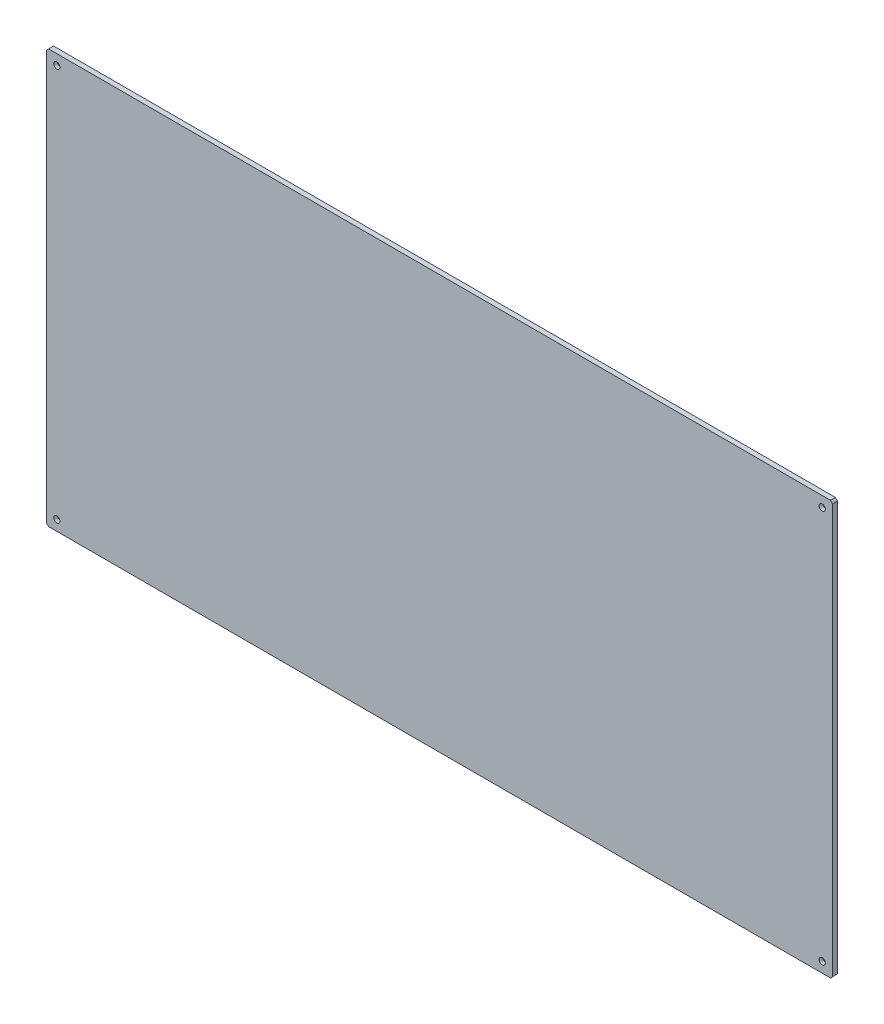
ISO-10303-21;
HEADER;
FILE_DESCRIPTION(('STEP AP214'),'2;1');
FILE_NAME('part.step','',(''),(''),'','','');
FILE_SCHEMA(('AUTOMOTIVE_DESIGN { 1 0 10303 214 1 1 1 1 }'));
ENDSEC;
DATA;
#1=APPLICATION_CONTEXT('core data for automotive mechanical design processes');
#2=APPLICATION_PROTOCOL_DEFINITION('international standard','automotive_design',2000,#1);
#3=PRODUCT_CONTEXT('',#1,'mechanical');
#4=PRODUCT('Part','Part','',(#3));
#5=PRODUCT_RELATED_PRODUCT_CATEGORY('part','',(#4));
#6=PRODUCT_DEFINITION_FORMATION('','',#4);
#7=PRODUCT_DEFINITION_CONTEXT('part definition',#1,'design');
#8=PRODUCT_DEFINITION('design','',#6,#7);
#9=PRODUCT_DEFINITION_SHAPE('','',#8);
#10=(LENGTH_UNIT() NAMED_UNIT(*) SI_UNIT(.MILLI.,.METRE.));
#11=(NAMED_UNIT(*) PLANE_ANGLE_UNIT() SI_UNIT($,.RADIAN.));
#12=(NAMED_UNIT(*) SI_UNIT($,.STERADIAN.) SOLID_ANGLE_UNIT());
#13=UNCERTAINTY_MEASURE_WITH_UNIT(LENGTH_MEASURE(1.E-05),#10,'distance_accuracy_value','');
#14=(GEOMETRIC_REPRESENTATION_CONTEXT(3) GLOBAL_UNCERTAINTY_ASSIGNED_CONTEXT((#13)) GLOBAL_UNIT_ASSIGNED_CONTEXT((#10,
#11,#12)) REPRESENTATION_CONTEXT('',''));
#15=CARTESIAN_POINT('',(0.,0.,0.));
#16=DIRECTION('',(0.,0.,1.));
#17=DIRECTION('',(1.,0.,0.));
#18=AXIS2_PLACEMENT_3D('',#15,#16,#17);
#19=CARTESIAN_POINT('',(-950.,-500.,6.));
#20=DIRECTION('',(1.,0.,0.));
#21=DIRECTION('',(0.,0.,-1.));
#22=AXIS2_PLACEMENT_3D('',#19,#20,#21);
#23=PLANE('',#22);
#24=DIRECTION('',(0.,-1.,0.));
#25=VECTOR('',#24,1.);
#26=CARTESIAN_POINT('',(-950.,-500.,6.));
#27=LINE('',#26,#25);
#28=CARTESIAN_POINT('',(-950.,494.999999999999,6.));
#29=VERTEX_POINT('',#28);
#30=CARTESIAN_POINT('',(-950.,-495.,6.));
#31=VERTEX_POINT('',#30);
#32=EDGE_CURVE('E120',#29,#31,#27,.T.);
#33=ORIENTED_EDGE('',*,*,#32,.F.);
#34=DIRECTION('',(0.,0.,-1.));
#35=VECTOR('',#34,1.);
#36=CARTESIAN_POINT('',(-950.,494.999999999999,6.));
#37=LINE('',#36,#35);
#38=CARTESIAN_POINT('',(-950.,494.999999999999,-6.));
#39=VERTEX_POINT('',#38);
#40=EDGE_CURVE('E105',#29,#39,#37,.T.);
#41=ORIENTED_EDGE('',*,*,#40,.T.);
#42=DIRECTION('',(0.,-1.,0.));
#43=VECTOR('',#42,1.);
#44=CARTESIAN_POINT('',(-950.,-500.,-6.));
#45=LINE('',#44,#43);
#46=CARTESIAN_POINT('',(-950.,-495.,-6.));
#47=VERTEX_POINT('',#46);
#48=EDGE_CURVE('E117',#39,#47,#45,.T.);
#49=ORIENTED_EDGE('',*,*,#48,.T.);
#50=DIRECTION('',(0.,0.,1.));
#51=VECTOR('',#50,1.);
#52=CARTESIAN_POINT('',(-950.,-495.,6.));
#53=LINE('',#52,#51);
#54=EDGE_CURVE('E122',#47,#31,#53,.T.);
#55=ORIENTED_EDGE('',*,*,#54,.T.);
#56=EDGE_LOOP('',(#33,#41,#49,#55));
#57=FACE_BOUND('',#56,.T.);
#58=ADVANCED_FACE('F34',(#57),#23,.F.);
#59=CARTESIAN_POINT('',(950.,-500.,6.));
#60=DIRECTION('',(0.,1.,0.));
#61=DIRECTION('',(-1.,0.,0.));
#62=AXIS2_PLACEMENT_3D('',#59,#60,#61);
#63=PLANE('',#62);
#64=DIRECTION('',(1.,0.,0.));
#65=VECTOR('',#64,1.);
#66=CARTESIAN_POINT('',(950.,-500.,6.));
#67=LINE('',#66,#65);
#68=CARTESIAN_POINT('',(-944.999999999999,-500.,6.));
#69=VERTEX_POINT('',#68);
#70=CARTESIAN_POINT('',(945.,-500.,6.));
#71=VERTEX_POINT('',#70);
#72=EDGE_CURVE('E164',#69,#71,#67,.T.);
#73=ORIENTED_EDGE('',*,*,#72,.F.);
#74=DIRECTION('',(0.,0.,-1.));
#75=VECTOR('',#74,1.);
#76=CARTESIAN_POINT('',(-945.,-500.,6.));
#77=LINE('',#76,#75);
#78=CARTESIAN_POINT('',(-944.999999999999,-500.,-6.));
#79=VERTEX_POINT('',#78);
#80=EDGE_CURVE('E11',#69,#79,#77,.T.);
#81=ORIENTED_EDGE('',*,*,#80,.T.);
#82=DIRECTION('',(1.,0.,0.));
#83=VECTOR('',#82,1.);
#84=CARTESIAN_POINT('',(950.,-500.,-6.));
#85=LINE('',#84,#83);
#86=CARTESIAN_POINT('',(945.,-500.,-6.));
#87=VERTEX_POINT('',#86);
#88=EDGE_CURVE('E127',#79,#87,#85,.T.);
#89=ORIENTED_EDGE('',*,*,#88,.T.);
#90=DIRECTION('',(0.,0.,1.));
#91=VECTOR('',#90,1.);
#92=CARTESIAN_POINT('',(945.,-500.,6.));
#93=LINE('',#92,#91);
#94=EDGE_CURVE('E42',#87,#71,#93,.T.);
#95=ORIENTED_EDGE('',*,*,#94,.T.);
#96=EDGE_LOOP('',(#73,#81,#89,#95));
#97=FACE_BOUND('',#96,.T.);
#98=ADVANCED_FACE('F163',(#97),#63,.F.);
#99=CARTESIAN_POINT('',(950.,-500.,6.));
#100=DIRECTION('',(-1.,0.,0.));
#101=DIRECTION('',(0.,0.,1.));
#102=AXIS2_PLACEMENT_3D('',#99,#100,#101);
#103=PLANE('',#102);
#104=DIRECTION('',(0.,1.,0.));
#105=VECTOR('',#104,1.);
#106=CARTESIAN_POINT('',(950.,-500.,-6.));
#107=LINE('',#106,#105);
#108=CARTESIAN_POINT('',(950.,-495.,-6.));
#109=VERTEX_POINT('',#108);
#110=CARTESIAN_POINT('',(950.,495.,-6.));
#111=VERTEX_POINT('',#110);
#112=EDGE_CURVE('E131',#109,#111,#107,.T.);
#113=ORIENTED_EDGE('',*,*,#112,.T.);
#114=DIRECTION('',(0.,0.,1.));
#115=VECTOR('',#114,1.);
#116=CARTESIAN_POINT('',(950.,495.,6.));
#117=LINE('',#116,#115);
#118=CARTESIAN_POINT('',(950.,495.,6.));
#119=VERTEX_POINT('',#118);
#120=EDGE_CURVE('E49',#111,#119,#117,.T.);
#121=ORIENTED_EDGE('',*,*,#120,.T.);
#122=DIRECTION('',(0.,1.,0.));
#123=VECTOR('',#122,1.);
#124=CARTESIAN_POINT('',(950.,-500.,6.));
#125=LINE('',#124,#123);
#126=CARTESIAN_POINT('',(950.,-495.,6.));
#127=VERTEX_POINT('',#126);
#128=EDGE_CURVE('E170',#127,#119,#125,.T.);
#129=ORIENTED_EDGE('',*,*,#128,.F.);
#130=DIRECTION('',(0.,0.,-1.));
#131=VECTOR('',#130,1.);
#132=CARTESIAN_POINT('',(950.,-495.,6.));
#133=LINE('',#132,#131);
#134=EDGE_CURVE('E157',#127,#109,#133,.T.);
#135=ORIENTED_EDGE('',*,*,#134,.T.);
#136=EDGE_LOOP('',(#113,#121,#129,#135));
#137=FACE_BOUND('',#136,.T.);
#138=ADVANCED_FACE('F174',(#137),#103,.F.);
#139=CARTESIAN_POINT('',(950.,500.,6.));
#140=DIRECTION('',(0.,-1.,0.));
#141=DIRECTION('',(1.,0.,0.));
#142=AXIS2_PLACEMENT_3D('',#139,#140,#141);
#143=PLANE('',#142);
#144=DIRECTION('',(-1.,0.,0.));
#145=VECTOR('',#144,1.);
#146=CARTESIAN_POINT('',(950.,500.,-6.));
#147=LINE('',#146,#145);
#148=CARTESIAN_POINT('',(945.,500.,-6.));
#149=VERTEX_POINT('',#148);
#150=CARTESIAN_POINT('',(-944.999999999999,500.,-6.));
#151=VERTEX_POINT('',#150);
#152=EDGE_CURVE('E141',#149,#151,#147,.T.);
#153=ORIENTED_EDGE('',*,*,#152,.T.);
#154=DIRECTION('',(0.,0.,1.));
#155=VECTOR('',#154,1.);
#156=CARTESIAN_POINT('',(-945.,500.,6.));
#157=LINE('',#156,#155);
#158=CARTESIAN_POINT('',(-945.,500.,6.));
#159=VERTEX_POINT('',#158);
#160=EDGE_CURVE('E106',#151,#159,#157,.T.);
#161=ORIENTED_EDGE('',*,*,#160,.T.);
#162=DIRECTION('',(-1.,0.,0.));
#163=VECTOR('',#162,1.);
#164=CARTESIAN_POINT('',(950.,500.,6.));
#165=LINE('',#164,#163);
#166=CARTESIAN_POINT('',(945.,500.,6.));
#167=VERTEX_POINT('',#166);
#168=EDGE_CURVE('E137',#167,#159,#165,.T.);
#169=ORIENTED_EDGE('',*,*,#168,.F.);
#170=DIRECTION('',(0.,0.,-1.));
#171=VECTOR('',#170,1.);
#172=CARTESIAN_POINT('',(945.,500.,6.));
#173=LINE('',#172,#171);
#174=EDGE_CURVE('E111',#167,#149,#173,.T.);
#175=ORIENTED_EDGE('',*,*,#174,.T.);
#176=EDGE_LOOP('',(#153,#161,#169,#175));
#177=FACE_BOUND('',#176,.T.);
#178=ADVANCED_FACE('F181',(#177),#143,.F.);
#179=CARTESIAN_POINT('',(0.,0.,6.));
#180=DIRECTION('',(0.,0.,1.));
#181=DIRECTION('',(1.,0.,0.));
#182=AXIS2_PLACEMENT_3D('',#179,#180,#181);
#183=PLANE('',#182);
#184=CARTESIAN_POINT('',(925.,475.,6.));
#185=DIRECTION('',(0.,0.,1.));
#186=DIRECTION('',(1.,0.,0.));
#187=AXIS2_PLACEMENT_3D('',#184,#185,#186);
#188=CIRCLE('',#187,7.49999999999995);
#189=CARTESIAN_POINT('',(932.5,475.,6.));
#190=VERTEX_POINT('',#189);
#191=EDGE_CURVE('E225',#190,#190,#188,.T.);
#192=ORIENTED_EDGE('',*,*,#191,.F.);
#193=EDGE_LOOP('',(#192));
#194=FACE_BOUND('',#193,.T.);
#195=CARTESIAN_POINT('',(925.,-475.,6.));
#196=DIRECTION('',(0.,0.,1.));
#197=DIRECTION('',(1.,0.,0.));
#198=AXIS2_PLACEMENT_3D('',#195,#196,#197);
#199=CIRCLE('',#198,7.49999999999995);
#200=CARTESIAN_POINT('',(932.5,-475.,6.));
#201=VERTEX_POINT('',#200);
#202=EDGE_CURVE('E213',#201,#201,#199,.T.);
#203=ORIENTED_EDGE('',*,*,#202,.F.);
#204=EDGE_LOOP('',(#203));
#205=FACE_BOUND('',#204,.T.);
#206=CARTESIAN_POINT('',(-925.,-475.,6.));
#207=DIRECTION('',(0.,0.,1.));
#208=DIRECTION('',(1.,0.,0.));
#209=AXIS2_PLACEMENT_3D('',#206,#207,#208);
#210=CIRCLE('',#209,7.49999999999995);
#211=CARTESIAN_POINT('',(-917.5,-475.,6.));
#212=VERTEX_POINT('',#211);
#213=EDGE_CURVE('E201',#212,#212,#210,.T.);
#214=ORIENTED_EDGE('',*,*,#213,.F.);
#215=EDGE_LOOP('',(#214));
#216=FACE_BOUND('',#215,.T.);
#217=CARTESIAN_POINT('',(-925.,475.,6.));
#218=DIRECTION('',(0.,0.,1.));
#219=DIRECTION('',(1.,0.,0.));
#220=AXIS2_PLACEMENT_3D('',#217,#218,#219);
#221=CIRCLE('',#220,7.49999999999995);
#222=CARTESIAN_POINT('',(-917.5,475.,6.));
#223=VERTEX_POINT('',#222);
#224=EDGE_CURVE('E189',#223,#223,#221,.T.);
#225=ORIENTED_EDGE('',*,*,#224,.F.);
#226=EDGE_LOOP('',(#225));
#227=FACE_BOUND('',#226,.T.);
#228=ORIENTED_EDGE('',*,*,#168,.T.);
#229=DIRECTION('',(0.707106781186536,0.707106781186559,0.));
#230=VECTOR('',#229,1.);
#231=CARTESIAN_POINT('',(-722.500000000016,722.499999999991,6.));
#232=LINE('',#231,#230);
#233=EDGE_CURVE('E155',#159,#29,#232,.F.);
#234=ORIENTED_EDGE('',*,*,#233,.T.);
#235=ORIENTED_EDGE('',*,*,#32,.T.);
#236=DIRECTION('',(-0.707106781186563,0.707106781186532,0.));
#237=VECTOR('',#236,1.);
#238=CARTESIAN_POINT('',(-722.499999999979,-722.500000000011,6.));
#239=LINE('',#238,#237);
#240=EDGE_CURVE('E151',#31,#69,#239,.F.);
#241=ORIENTED_EDGE('',*,*,#240,.T.);
#242=ORIENTED_EDGE('',*,*,#72,.T.);
#243=DIRECTION('',(-0.707106781186548,-0.707106781186548,0.));
#244=VECTOR('',#243,1.);
#245=CARTESIAN_POINT('',(722.5,-722.5,6.));
#246=LINE('',#245,#244);
#247=EDGE_CURVE('E56',#71,#127,#246,.F.);
#248=ORIENTED_EDGE('',*,*,#247,.T.);
#249=ORIENTED_EDGE('',*,*,#128,.T.);
#250=DIRECTION('',(0.707106781186559,-0.707106781186536,0.));
#251=VECTOR('',#250,1.);
#252=CARTESIAN_POINT('',(722.499999999984,722.500000000008,6.));
#253=LINE('',#252,#251);
#254=EDGE_CURVE('E153',#119,#167,#253,.F.);
#255=ORIENTED_EDGE('',*,*,#254,.T.);
#256=EDGE_LOOP('',(#228,#234,#235,#241,#242,#248,#249,#255));
#257=FACE_BOUND('',#256,.T.);
#258=ADVANCED_FACE('F168',(#194,#205,#216,#227,#257),#183,.T.);
#259=CARTESIAN_POINT('',(0.,0.,-6.));
#260=DIRECTION('',(0.,0.,1.));
#261=DIRECTION('',(1.,0.,0.));
#262=AXIS2_PLACEMENT_3D('',#259,#260,#261);
#263=PLANE('',#262);
#264=CARTESIAN_POINT('',(925.,475.,-6.));
#265=DIRECTION('',(0.,0.,1.));
#266=DIRECTION('',(1.,0.,0.));
#267=AXIS2_PLACEMENT_3D('',#264,#265,#266);
#268=CIRCLE('',#267,4.49999999999995);
#269=CARTESIAN_POINT('',(929.5,475.,-6.));
#270=VERTEX_POINT('',#269);
#271=EDGE_CURVE('E216',#270,#270,#268,.T.);
#272=ORIENTED_EDGE('',*,*,#271,.T.);
#273=EDGE_LOOP('',(#272));
#274=FACE_BOUND('',#273,.T.);
#275=CARTESIAN_POINT('',(925.,-475.,-6.));
#276=DIRECTION('',(0.,0.,1.));
#277=DIRECTION('',(1.,0.,0.));
#278=AXIS2_PLACEMENT_3D('',#275,#276,#277);
#279=CIRCLE('',#278,4.49999999999995);
#280=CARTESIAN_POINT('',(929.5,-475.,-6.));
#281=VERTEX_POINT('',#280);
#282=EDGE_CURVE('E204',#281,#281,#279,.T.);
#283=ORIENTED_EDGE('',*,*,#282,.T.);
#284=EDGE_LOOP('',(#283));
#285=FACE_BOUND('',#284,.T.);
#286=CARTESIAN_POINT('',(-925.,-475.,-6.));
#287=DIRECTION('',(0.,0.,1.));
#288=DIRECTION('',(1.,0.,0.));
#289=AXIS2_PLACEMENT_3D('',#286,#287,#288);
#290=CIRCLE('',#289,4.49999999999995);
#291=CARTESIAN_POINT('',(-920.5,-475.,-6.));
#292=VERTEX_POINT('',#291);
#293=EDGE_CURVE('E192',#292,#292,#290,.T.);
#294=ORIENTED_EDGE('',*,*,#293,.T.);
#295=EDGE_LOOP('',(#294));
#296=FACE_BOUND('',#295,.T.);
#297=CARTESIAN_POINT('',(-925.,475.,-6.));
#298=DIRECTION('',(0.,0.,1.));
#299=DIRECTION('',(1.,0.,0.));
#300=AXIS2_PLACEMENT_3D('',#297,#298,#299);
#301=CIRCLE('',#300,4.49999999999995);
#302=CARTESIAN_POINT('',(-920.5,475.,-6.));
#303=VERTEX_POINT('',#302);
#304=EDGE_CURVE('E128',#303,#303,#301,.T.);
#305=ORIENTED_EDGE('',*,*,#304,.T.);
#306=EDGE_LOOP('',(#305));
#307=FACE_BOUND('',#306,.T.);
#308=ORIENTED_EDGE('',*,*,#48,.F.);
#309=DIRECTION('',(-0.707106781186536,-0.707106781186559,0.));
#310=VECTOR('',#309,1.);
#311=CARTESIAN_POINT('',(-950.,494.999999999999,-6.));
#312=LINE('',#311,#310);
#313=EDGE_CURVE('E101',#39,#151,#312,.F.);
#314=ORIENTED_EDGE('',*,*,#313,.T.);
#315=ORIENTED_EDGE('',*,*,#152,.F.);
#316=DIRECTION('',(-0.707106781186559,0.707106781186536,0.));
#317=VECTOR('',#316,1.);
#318=CARTESIAN_POINT('',(945.,500.,-6.));
#319=LINE('',#318,#317);
#320=EDGE_CURVE('E112',#149,#111,#319,.F.);
#321=ORIENTED_EDGE('',*,*,#320,.T.);
#322=ORIENTED_EDGE('',*,*,#112,.F.);
#323=DIRECTION('',(0.707106781186548,0.707106781186548,0.));
#324=VECTOR('',#323,1.);
#325=CARTESIAN_POINT('',(950.,-495.,-6.));
#326=LINE('',#325,#324);
#327=EDGE_CURVE('E121',#109,#87,#326,.F.);
#328=ORIENTED_EDGE('',*,*,#327,.T.);
#329=ORIENTED_EDGE('',*,*,#88,.F.);
#330=DIRECTION('',(0.707106781186563,-0.707106781186532,0.));
#331=VECTOR('',#330,1.);
#332=CARTESIAN_POINT('',(-945.,-500.,-6.));
#333=LINE('',#332,#331);
#334=EDGE_CURVE('E126',#79,#47,#333,.F.);
#335=ORIENTED_EDGE('',*,*,#334,.T.);
#336=EDGE_LOOP('',(#308,#314,#315,#321,#322,#328,#329,#335));
#337=FACE_BOUND('',#336,.T.);
#338=ADVANCED_FACE('F124',(#274,#285,#296,#307,#337),#263,.F.);
#339=CARTESIAN_POINT('',(-925.,475.,6.));
#340=DIRECTION('',(0.,0.,1.));
#341=DIRECTION('',(1.,0.,0.));
#342=AXIS2_PLACEMENT_3D('',#339,#340,#341);
#343=CYLINDRICAL_SURFACE('',#342,4.49999999999995);
#344=ORIENTED_EDGE('',*,*,#304,.F.);
#345=EDGE_LOOP('',(#344));
#346=FACE_BOUND('',#345,.T.);
#347=CARTESIAN_POINT('',(-925.,475.,-3.));
#348=DIRECTION('',(0.,0.,1.));
#349=DIRECTION('',(1.,0.,0.));
#350=AXIS2_PLACEMENT_3D('',#347,#348,#349);
#351=CIRCLE('',#350,4.49999999999995);
#352=CARTESIAN_POINT('',(-920.5,475.,-3.));
#353=VERTEX_POINT('',#352);
#354=EDGE_CURVE('E134',#353,#353,#351,.T.);
#355=ORIENTED_EDGE('',*,*,#354,.T.);
#356=EDGE_LOOP('',(#355));
#357=FACE_BOUND('',#356,.T.);
#358=ADVANCED_FACE('F253',(#346,#357),#343,.F.);
#359=CARTESIAN_POINT('',(-920.5,475.,-3.));
#360=DIRECTION('',(0.,0.,-1.));
#361=DIRECTION('',(-1.,0.,0.));
#362=AXIS2_PLACEMENT_3D('',#359,#360,#361);
#363=PLANE('',#362);
#364=ORIENTED_EDGE('',*,*,#354,.F.);
#365=EDGE_LOOP('',(#364));
#366=FACE_BOUND('',#365,.T.);
#367=CARTESIAN_POINT('',(-925.,475.,-3.));
#368=DIRECTION('',(0.,0.,1.));
#369=DIRECTION('',(1.,0.,0.));
#370=AXIS2_PLACEMENT_3D('',#367,#368,#369);
#371=CIRCLE('',#370,7.49999999999995);
#372=CARTESIAN_POINT('',(-917.5,475.,-3.));
#373=VERTEX_POINT('',#372);
#374=EDGE_CURVE('E186',#373,#373,#371,.T.);
#375=ORIENTED_EDGE('',*,*,#374,.T.);
#376=EDGE_LOOP('',(#375));
#377=FACE_BOUND('',#376,.T.);
#378=ADVANCED_FACE('F243',(#366,#377),#363,.F.);
#379=CARTESIAN_POINT('',(-925.,475.,6.));
#380=DIRECTION('',(0.,0.,1.));
#381=DIRECTION('',(1.,0.,0.));
#382=AXIS2_PLACEMENT_3D('',#379,#380,#381);
#383=CYLINDRICAL_SURFACE('',#382,7.49999999999995);
#384=ORIENTED_EDGE('',*,*,#374,.F.);
#385=EDGE_LOOP('',(#384));
#386=FACE_BOUND('',#385,.T.);
#387=ORIENTED_EDGE('',*,*,#224,.T.);
#388=EDGE_LOOP('',(#387));
#389=FACE_BOUND('',#388,.T.);
#390=ADVANCED_FACE('F240',(#386,#389),#383,.F.);
#391=CARTESIAN_POINT('',(-925.,-475.,6.));
#392=DIRECTION('',(0.,0.,1.));
#393=DIRECTION('',(1.,0.,0.));
#394=AXIS2_PLACEMENT_3D('',#391,#392,#393);
#395=CYLINDRICAL_SURFACE('',#394,4.49999999999995);
#396=ORIENTED_EDGE('',*,*,#293,.F.);
#397=EDGE_LOOP('',(#396));
#398=FACE_BOUND('',#397,.T.);
#399=CARTESIAN_POINT('',(-925.,-475.,-3.));
#400=DIRECTION('',(0.,0.,1.));
#401=DIRECTION('',(1.,0.,0.));
#402=AXIS2_PLACEMENT_3D('',#399,#400,#401);
#403=CIRCLE('',#402,4.49999999999995);
#404=CARTESIAN_POINT('',(-920.5,-475.,-3.));
#405=VERTEX_POINT('',#404);
#406=EDGE_CURVE('E195',#405,#405,#403,.T.);
#407=ORIENTED_EDGE('',*,*,#406,.T.);
#408=EDGE_LOOP('',(#407));
#409=FACE_BOUND('',#408,.T.);
#410=ADVANCED_FACE('F242',(#398,#409),#395,.F.);
#411=CARTESIAN_POINT('',(-920.5,-475.,-3.));
#412=DIRECTION('',(0.,0.,-1.));
#413=DIRECTION('',(-1.,0.,0.));
#414=AXIS2_PLACEMENT_3D('',#411,#412,#413);
#415=PLANE('',#414);
#416=ORIENTED_EDGE('',*,*,#406,.F.);
#417=EDGE_LOOP('',(#416));
#418=FACE_BOUND('',#417,.T.);
#419=CARTESIAN_POINT('',(-925.,-475.,-3.));
#420=DIRECTION('',(0.,0.,1.));
#421=DIRECTION('',(1.,0.,0.));
#422=AXIS2_PLACEMENT_3D('',#419,#420,#421);
#423=CIRCLE('',#422,7.49999999999995);
#424=CARTESIAN_POINT('',(-917.5,-475.,-3.));
#425=VERTEX_POINT('',#424);
#426=EDGE_CURVE('E198',#425,#425,#423,.T.);
#427=ORIENTED_EDGE('',*,*,#426,.T.);
#428=EDGE_LOOP('',(#427));
#429=FACE_BOUND('',#428,.T.);
#430=ADVANCED_FACE('F250',(#418,#429),#415,.F.);
#431=CARTESIAN_POINT('',(-925.,-475.,6.));
#432=DIRECTION('',(0.,0.,1.));
#433=DIRECTION('',(1.,0.,0.));
#434=AXIS2_PLACEMENT_3D('',#431,#432,#433);
#435=CYLINDRICAL_SURFACE('',#434,7.49999999999995);
#436=ORIENTED_EDGE('',*,*,#426,.F.);
#437=EDGE_LOOP('',(#436));
#438=FACE_BOUND('',#437,.T.);
#439=ORIENTED_EDGE('',*,*,#213,.T.);
#440=EDGE_LOOP('',(#439));
#441=FACE_BOUND('',#440,.T.);
#442=ADVANCED_FACE('F393',(#438,#441),#435,.F.);
#443=CARTESIAN_POINT('',(925.,-475.,6.));
#444=DIRECTION('',(0.,0.,1.));
#445=DIRECTION('',(1.,0.,0.));
#446=AXIS2_PLACEMENT_3D('',#443,#444,#445);
#447=CYLINDRICAL_SURFACE('',#446,4.49999999999995);
#448=ORIENTED_EDGE('',*,*,#282,.F.);
#449=EDGE_LOOP('',(#448));
#450=FACE_BOUND('',#449,.T.);
#451=CARTESIAN_POINT('',(925.,-475.,-3.));
#452=DIRECTION('',(0.,0.,1.));
#453=DIRECTION('',(1.,0.,0.));
#454=AXIS2_PLACEMENT_3D('',#451,#452,#453);
#455=CIRCLE('',#454,4.49999999999995);
#456=CARTESIAN_POINT('',(929.5,-475.,-3.));
#457=VERTEX_POINT('',#456);
#458=EDGE_CURVE('E207',#457,#457,#455,.T.);
#459=ORIENTED_EDGE('',*,*,#458,.T.);
#460=EDGE_LOOP('',(#459));
#461=FACE_BOUND('',#460,.T.);
#462=ADVANCED_FACE('F383',(#450,#461),#447,.F.);
#463=CARTESIAN_POINT('',(929.5,-475.,-3.));
#464=DIRECTION('',(0.,0.,-1.));
#465=DIRECTION('',(-1.,0.,0.));
#466=AXIS2_PLACEMENT_3D('',#463,#464,#465);
#467=PLANE('',#466);
#468=ORIENTED_EDGE('',*,*,#458,.F.);
#469=EDGE_LOOP('',(#468));
#470=FACE_BOUND('',#469,.T.);
#471=CARTESIAN_POINT('',(925.,-475.,-3.));
#472=DIRECTION('',(0.,0.,1.));
#473=DIRECTION('',(1.,0.,0.));
#474=AXIS2_PLACEMENT_3D('',#471,#472,#473);
#475=CIRCLE('',#474,7.49999999999995);
#476=CARTESIAN_POINT('',(932.5,-475.,-3.));
#477=VERTEX_POINT('',#476);
#478=EDGE_CURVE('E210',#477,#477,#475,.T.);
#479=ORIENTED_EDGE('',*,*,#478,.T.);
#480=EDGE_LOOP('',(#479));
#481=FACE_BOUND('',#480,.T.);
#482=ADVANCED_FACE('F373',(#470,#481),#467,.F.);
#483=CARTESIAN_POINT('',(925.,-475.,6.));
#484=DIRECTION('',(0.,0.,1.));
#485=DIRECTION('',(1.,0.,0.));
#486=AXIS2_PLACEMENT_3D('',#483,#484,#485);
#487=CYLINDRICAL_SURFACE('',#486,7.49999999999995);
#488=ORIENTED_EDGE('',*,*,#478,.F.);
#489=EDGE_LOOP('',(#488));
#490=FACE_BOUND('',#489,.T.);
#491=ORIENTED_EDGE('',*,*,#202,.T.);
#492=EDGE_LOOP('',(#491));
#493=FACE_BOUND('',#492,.T.);
#494=ADVANCED_FACE('F363',(#490,#493),#487,.F.);
#495=CARTESIAN_POINT('',(925.,475.,6.));
#496=DIRECTION('',(0.,0.,1.));
#497=DIRECTION('',(1.,0.,0.));
#498=AXIS2_PLACEMENT_3D('',#495,#496,#497);
#499=CYLINDRICAL_SURFACE('',#498,4.49999999999995);
#500=ORIENTED_EDGE('',*,*,#271,.F.);
#501=EDGE_LOOP('',(#500));
#502=FACE_BOUND('',#501,.T.);
#503=CARTESIAN_POINT('',(925.,475.,-3.));
#504=DIRECTION('',(0.,0.,1.));
#505=DIRECTION('',(1.,0.,0.));
#506=AXIS2_PLACEMENT_3D('',#503,#504,#505);
#507=CIRCLE('',#506,4.49999999999995);
#508=CARTESIAN_POINT('',(929.5,475.,-3.));
#509=VERTEX_POINT('',#508);
#510=EDGE_CURVE('E219',#509,#509,#507,.T.);
#511=ORIENTED_EDGE('',*,*,#510,.T.);
#512=EDGE_LOOP('',(#511));
#513=FACE_BOUND('',#512,.T.);
#514=ADVANCED_FACE('F353',(#502,#513),#499,.F.);
#515=CARTESIAN_POINT('',(929.5,475.,-3.));
#516=DIRECTION('',(0.,0.,-1.));
#517=DIRECTION('',(-1.,0.,0.));
#518=AXIS2_PLACEMENT_3D('',#515,#516,#517);
#519=PLANE('',#518);
#520=ORIENTED_EDGE('',*,*,#510,.F.);
#521=EDGE_LOOP('',(#520));
#522=FACE_BOUND('',#521,.T.);
#523=CARTESIAN_POINT('',(925.,475.,-3.));
#524=DIRECTION('',(0.,0.,1.));
#525=DIRECTION('',(1.,0.,0.));
#526=AXIS2_PLACEMENT_3D('',#523,#524,#525);
#527=CIRCLE('',#526,7.49999999999995);
#528=CARTESIAN_POINT('',(932.5,475.,-3.));
#529=VERTEX_POINT('',#528);
#530=EDGE_CURVE('E222',#529,#529,#527,.T.);
#531=ORIENTED_EDGE('',*,*,#530,.T.);
#532=EDGE_LOOP('',(#531));
#533=FACE_BOUND('',#532,.T.);
#534=ADVANCED_FACE('F343',(#522,#533),#519,.F.);
#535=CARTESIAN_POINT('',(925.,475.,6.));
#536=DIRECTION('',(0.,0.,1.));
#537=DIRECTION('',(1.,0.,0.));
#538=AXIS2_PLACEMENT_3D('',#535,#536,#537);
#539=CYLINDRICAL_SURFACE('',#538,7.49999999999995);
#540=ORIENTED_EDGE('',*,*,#530,.F.);
#541=EDGE_LOOP('',(#540));
#542=FACE_BOUND('',#541,.T.);
#543=ORIENTED_EDGE('',*,*,#191,.T.);
#544=EDGE_LOOP('',(#543));
#545=FACE_BOUND('',#544,.T.);
#546=ADVANCED_FACE('F229',(#542,#545),#539,.F.);
#547=CARTESIAN_POINT('',(-950.,494.999999999999,6.));
#548=DIRECTION('',(0.707106781186559,-0.707106781186536,0.));
#549=DIRECTION('',(0.,0.,-1.));
#550=AXIS2_PLACEMENT_3D('',#547,#548,#549);
#551=PLANE('',#550);
#552=ORIENTED_EDGE('',*,*,#233,.F.);
#553=ORIENTED_EDGE('',*,*,#160,.F.);
#554=ORIENTED_EDGE('',*,*,#313,.F.);
#555=ORIENTED_EDGE('',*,*,#40,.F.);
#556=EDGE_LOOP('',(#552,#553,#554,#555));
#557=FACE_BOUND('',#556,.T.);
#558=ADVANCED_FACE('F104',(#557),#551,.F.);
#559=CARTESIAN_POINT('',(945.,500.,6.));
#560=DIRECTION('',(-0.707106781186536,-0.707106781186559,0.));
#561=DIRECTION('',(0.,0.,-1.));
#562=AXIS2_PLACEMENT_3D('',#559,#560,#561);
#563=PLANE('',#562);
#564=ORIENTED_EDGE('',*,*,#254,.F.);
#565=ORIENTED_EDGE('',*,*,#120,.F.);
#566=ORIENTED_EDGE('',*,*,#320,.F.);
#567=ORIENTED_EDGE('',*,*,#174,.F.);
#568=EDGE_LOOP('',(#564,#565,#566,#567));
#569=FACE_BOUND('',#568,.T.);
#570=ADVANCED_FACE('F178',(#569),#563,.F.);
#571=CARTESIAN_POINT('',(-945.,-500.,6.));
#572=DIRECTION('',(0.707106781186532,0.707106781186563,0.));
#573=DIRECTION('',(0.,0.,-1.));
#574=AXIS2_PLACEMENT_3D('',#571,#572,#573);
#575=PLANE('',#574);
#576=ORIENTED_EDGE('',*,*,#240,.F.);
#577=ORIENTED_EDGE('',*,*,#54,.F.);
#578=ORIENTED_EDGE('',*,*,#334,.F.);
#579=ORIENTED_EDGE('',*,*,#80,.F.);
#580=EDGE_LOOP('',(#576,#577,#578,#579));
#581=FACE_BOUND('',#580,.T.);
#582=ADVANCED_FACE('F268',(#581),#575,.F.);
#583=CARTESIAN_POINT('',(950.,-495.,6.));
#584=DIRECTION('',(-0.707106781186548,0.707106781186548,0.));
#585=DIRECTION('',(0.,0.,-1.));
#586=AXIS2_PLACEMENT_3D('',#583,#584,#585);
#587=PLANE('',#586);
#588=ORIENTED_EDGE('',*,*,#247,.F.);
#589=ORIENTED_EDGE('',*,*,#94,.F.);
#590=ORIENTED_EDGE('',*,*,#327,.F.);
#591=ORIENTED_EDGE('',*,*,#134,.F.);
#592=EDGE_LOOP('',(#588,#589,#590,#591));
#593=FACE_BOUND('',#592,.T.);
#594=ADVANCED_FACE('F36',(#593),#587,.F.);
#595=CLOSED_SHELL('',(#58,#98,#138,#178,#258,#338,#358,#378,#390,#410,#430,#442,#462,#482,#494,
#514,#534,#546,#558,#570,#582,#594));
#596=MANIFOLD_SOLID_BREP('B2',#595);
#597=ADVANCED_BREP_SHAPE_REPRESENTATION('',(#18,#596),#14);
#598=SHAPE_DEFINITION_REPRESENTATION(#9,#597);
ENDSEC;
END-ISO-10303-21;
